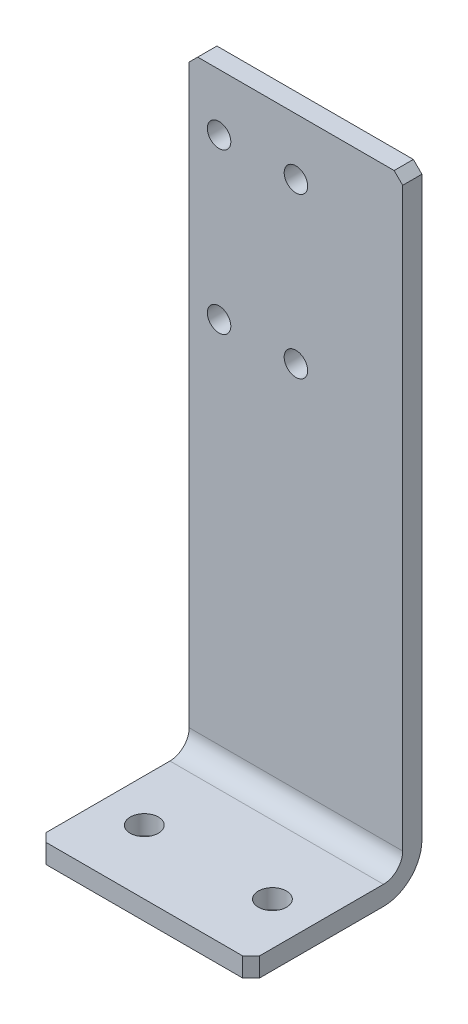
ISO-10303-21;
HEADER;
FILE_DESCRIPTION(('STEP AP214'),'2;1');
FILE_NAME('part.step','',(''),(''),'','','');
FILE_SCHEMA(('AUTOMOTIVE_DESIGN { 1 0 10303 214 1 1 1 1 }'));
ENDSEC;
DATA;
#1=APPLICATION_CONTEXT('core data for automotive mechanical design processes');
#2=APPLICATION_PROTOCOL_DEFINITION('international standard','automotive_design',2000,#1);
#3=PRODUCT_CONTEXT('',#1,'mechanical');
#4=PRODUCT('Part','Part','',(#3));
#5=PRODUCT_RELATED_PRODUCT_CATEGORY('part','',(#4));
#6=PRODUCT_DEFINITION_FORMATION('','',#4);
#7=PRODUCT_DEFINITION_CONTEXT('part definition',#1,'design');
#8=PRODUCT_DEFINITION('design','',#6,#7);
#9=PRODUCT_DEFINITION_SHAPE('','',#8);
#10=(LENGTH_UNIT() NAMED_UNIT(*) SI_UNIT(.MILLI.,.METRE.));
#11=(NAMED_UNIT(*) PLANE_ANGLE_UNIT() SI_UNIT($,.RADIAN.));
#12=(NAMED_UNIT(*) SI_UNIT($,.STERADIAN.) SOLID_ANGLE_UNIT());
#13=UNCERTAINTY_MEASURE_WITH_UNIT(LENGTH_MEASURE(1.E-05),#10,'distance_accuracy_value','');
#14=(GEOMETRIC_REPRESENTATION_CONTEXT(3) GLOBAL_UNCERTAINTY_ASSIGNED_CONTEXT((#13)) GLOBAL_UNIT_ASSIGNED_CONTEXT((#10,
#11,#12)) REPRESENTATION_CONTEXT('',''));
#15=CARTESIAN_POINT('',(0.,0.,0.));
#16=DIRECTION('',(0.,0.,1.));
#17=DIRECTION('',(1.,0.,0.));
#18=AXIS2_PLACEMENT_3D('',#15,#16,#17);
#19=CARTESIAN_POINT('',(25.,4.5,4.5));
#20=DIRECTION('',(0.,0.,-1.));
#21=DIRECTION('',(-1.,0.,0.));
#22=AXIS2_PLACEMENT_3D('',#19,#20,#21);
#23=PLANE('',#22);
#24=CARTESIAN_POINT('',(-18.,132.7,4.5));
#25=DIRECTION('',(0.,0.,-1.));
#26=DIRECTION('',(-1.,0.,0.));
#27=AXIS2_PLACEMENT_3D('',#24,#25,#26);
#28=CIRCLE('',#27,2.74999999999999);
#29=CARTESIAN_POINT('',(-20.75,132.7,4.5));
#30=VERTEX_POINT('',#29);
#31=EDGE_CURVE('E286',#30,#30,#28,.T.);
#32=ORIENTED_EDGE('',*,*,#31,.T.);
#33=EDGE_LOOP('',(#32));
#34=FACE_BOUND('',#33,.T.);
#35=CARTESIAN_POINT('',(0.,132.7,4.5));
#36=DIRECTION('',(0.,0.,-1.));
#37=DIRECTION('',(-1.,0.,0.));
#38=AXIS2_PLACEMENT_3D('',#35,#36,#37);
#39=CIRCLE('',#38,2.74999999999999);
#40=CARTESIAN_POINT('',(-2.75,132.7,4.5));
#41=VERTEX_POINT('',#40);
#42=EDGE_CURVE('E280',#41,#41,#39,.T.);
#43=ORIENTED_EDGE('',*,*,#42,.T.);
#44=EDGE_LOOP('',(#43));
#45=FACE_BOUND('',#44,.T.);
#46=CARTESIAN_POINT('',(0.,95.3,4.5));
#47=DIRECTION('',(0.,0.,-1.));
#48=DIRECTION('',(-1.,0.,0.));
#49=AXIS2_PLACEMENT_3D('',#46,#47,#48);
#50=CIRCLE('',#49,2.74999999999999);
#51=CARTESIAN_POINT('',(-2.75,95.3,4.5));
#52=VERTEX_POINT('',#51);
#53=EDGE_CURVE('E274',#52,#52,#50,.T.);
#54=ORIENTED_EDGE('',*,*,#53,.T.);
#55=EDGE_LOOP('',(#54));
#56=FACE_BOUND('',#55,.T.);
#57=CARTESIAN_POINT('',(-18.,95.3,4.5));
#58=DIRECTION('',(0.,0.,-1.));
#59=DIRECTION('',(-1.,0.,0.));
#60=AXIS2_PLACEMENT_3D('',#57,#58,#59);
#61=CIRCLE('',#60,2.74999999999999);
#62=CARTESIAN_POINT('',(-20.75,95.3,4.5));
#63=VERTEX_POINT('',#62);
#64=EDGE_CURVE('E268',#63,#63,#61,.T.);
#65=ORIENTED_EDGE('',*,*,#64,.T.);
#66=EDGE_LOOP('',(#65));
#67=FACE_BOUND('',#66,.T.);
#68=DIRECTION('',(-1.,0.,0.));
#69=VECTOR('',#68,1.);
#70=CARTESIAN_POINT('',(25.,146.,4.5));
#71=LINE('',#70,#69);
#72=CARTESIAN_POINT('',(23.,146.,4.5));
#73=VERTEX_POINT('',#72);
#74=CARTESIAN_POINT('',(-23.,146.,4.5));
#75=VERTEX_POINT('',#74);
#76=EDGE_CURVE('E164',#73,#75,#71,.T.);
#77=ORIENTED_EDGE('',*,*,#76,.T.);
#78=DIRECTION('',(0.707106781186545,0.70710678118655,0.));
#79=VECTOR('',#78,1.);
#80=CARTESIAN_POINT('',(-23.,146.,4.5));
#81=LINE('',#80,#79);
#82=CARTESIAN_POINT('',(-25.,144.,4.5));
#83=VERTEX_POINT('',#82);
#84=EDGE_CURVE('E216',#75,#83,#81,.F.);
#85=ORIENTED_EDGE('',*,*,#84,.T.);
#86=DIRECTION('',(0.,-1.,0.));
#87=VECTOR('',#86,1.);
#88=CARTESIAN_POINT('',(-25.,4.5,4.5));
#89=LINE('',#88,#87);
#90=CARTESIAN_POINT('',(-25.,9.,4.5));
#91=VERTEX_POINT('',#90);
#92=EDGE_CURVE('E154',#83,#91,#89,.T.);
#93=ORIENTED_EDGE('',*,*,#92,.T.);
#94=DIRECTION('',(-1.,0.,0.));
#95=VECTOR('',#94,1.);
#96=CARTESIAN_POINT('',(25.,9.,4.5));
#97=LINE('',#96,#95);
#98=CARTESIAN_POINT('',(25.,9.,4.5));
#99=VERTEX_POINT('',#98);
#100=EDGE_CURVE('E133',#91,#99,#97,.F.);
#101=ORIENTED_EDGE('',*,*,#100,.T.);
#102=DIRECTION('',(0.,-1.,0.));
#103=VECTOR('',#102,1.);
#104=CARTESIAN_POINT('',(25.,4.5,4.5));
#105=LINE('',#104,#103);
#106=CARTESIAN_POINT('',(25.,144.,4.5));
#107=VERTEX_POINT('',#106);
#108=EDGE_CURVE('E163',#107,#99,#105,.T.);
#109=ORIENTED_EDGE('',*,*,#108,.F.);
#110=DIRECTION('',(-0.707106781186545,0.70710678118655,0.));
#111=VECTOR('',#110,1.);
#112=CARTESIAN_POINT('',(25.,144.,4.5));
#113=LINE('',#112,#111);
#114=EDGE_CURVE('E214',#107,#73,#113,.T.);
#115=ORIENTED_EDGE('',*,*,#114,.T.);
#116=EDGE_LOOP('',(#77,#85,#93,#101,#109,#115));
#117=FACE_BOUND('',#116,.T.);
#118=ADVANCED_FACE('F37',(#34,#45,#56,#67,#117),#23,.F.);
#119=CARTESIAN_POINT('',(25.,4.5,4.5));
#120=DIRECTION('',(0.,-1.,0.));
#121=DIRECTION('',(0.,0.,-1.));
#122=AXIS2_PLACEMENT_3D('',#119,#120,#121);
#123=PLANE('',#122);
#124=CARTESIAN_POINT('',(-15.,4.5,25.));
#125=DIRECTION('',(0.,1.,0.));
#126=DIRECTION('',(0.,0.,1.));
#127=AXIS2_PLACEMENT_3D('',#124,#125,#126);
#128=CIRCLE('',#127,3.3);
#129=CARTESIAN_POINT('',(-15.,4.5,28.3));
#130=VERTEX_POINT('',#129);
#131=EDGE_CURVE('E265',#130,#130,#128,.T.);
#132=ORIENTED_EDGE('',*,*,#131,.F.);
#133=EDGE_LOOP('',(#132));
#134=FACE_BOUND('',#133,.T.);
#135=CARTESIAN_POINT('',(15.,4.5,25.));
#136=DIRECTION('',(0.,1.,0.));
#137=DIRECTION('',(0.,0.,1.));
#138=AXIS2_PLACEMENT_3D('',#135,#136,#137);
#139=CIRCLE('',#138,3.3);
#140=CARTESIAN_POINT('',(15.,4.5,28.3));
#141=VERTEX_POINT('',#140);
#142=EDGE_CURVE('E259',#141,#141,#139,.T.);
#143=ORIENTED_EDGE('',*,*,#142,.F.);
#144=EDGE_LOOP('',(#143));
#145=FACE_BOUND('',#144,.T.);
#146=DIRECTION('',(0.,0.,1.));
#147=VECTOR('',#146,1.);
#148=CARTESIAN_POINT('',(-25.,4.5,4.5));
#149=LINE('',#148,#147);
#150=CARTESIAN_POINT('',(-25.,4.5,9.));
#151=VERTEX_POINT('',#150);
#152=CARTESIAN_POINT('',(-25.,4.5,38.));
#153=VERTEX_POINT('',#152);
#154=EDGE_CURVE('E143',#151,#153,#149,.T.);
#155=ORIENTED_EDGE('',*,*,#154,.T.);
#156=DIRECTION('',(-0.707106781186545,0.,-0.70710678118655));
#157=VECTOR('',#156,1.);
#158=CARTESIAN_POINT('',(-23.,4.5,40.));
#159=LINE('',#158,#157);
#160=CARTESIAN_POINT('',(-23.,4.5,40.));
#161=VERTEX_POINT('',#160);
#162=EDGE_CURVE('E202',#153,#161,#159,.F.);
#163=ORIENTED_EDGE('',*,*,#162,.T.);
#164=DIRECTION('',(-1.,0.,0.));
#165=VECTOR('',#164,1.);
#166=CARTESIAN_POINT('',(25.,4.5,40.));
#167=LINE('',#166,#165);
#168=CARTESIAN_POINT('',(23.,4.5,40.));
#169=VERTEX_POINT('',#168);
#170=EDGE_CURVE('E147',#169,#161,#167,.T.);
#171=ORIENTED_EDGE('',*,*,#170,.F.);
#172=DIRECTION('',(0.70710678118655,0.,-0.707106781186545));
#173=VECTOR('',#172,1.);
#174=CARTESIAN_POINT('',(25.,4.5,38.));
#175=LINE('',#174,#173);
#176=CARTESIAN_POINT('',(25.,4.5,38.));
#177=VERTEX_POINT('',#176);
#178=EDGE_CURVE('E200',#169,#177,#175,.T.);
#179=ORIENTED_EDGE('',*,*,#178,.T.);
#180=DIRECTION('',(0.,0.,1.));
#181=VECTOR('',#180,1.);
#182=CARTESIAN_POINT('',(25.,4.5,4.5));
#183=LINE('',#182,#181);
#184=CARTESIAN_POINT('',(25.,4.5,9.));
#185=VERTEX_POINT('',#184);
#186=EDGE_CURVE('E146',#185,#177,#183,.T.);
#187=ORIENTED_EDGE('',*,*,#186,.F.);
#188=DIRECTION('',(-1.,0.,0.));
#189=VECTOR('',#188,1.);
#190=CARTESIAN_POINT('',(-25.,4.5,9.));
#191=LINE('',#190,#189);
#192=EDGE_CURVE('E131',#185,#151,#191,.T.);
#193=ORIENTED_EDGE('',*,*,#192,.T.);
#194=EDGE_LOOP('',(#155,#163,#171,#179,#187,#193));
#195=FACE_BOUND('',#194,.T.);
#196=ADVANCED_FACE('F142',(#134,#145,#195),#123,.F.);
#197=CARTESIAN_POINT('',(25.,0.,40.));
#198=DIRECTION('',(0.,0.,-1.));
#199=DIRECTION('',(-1.,0.,0.));
#200=AXIS2_PLACEMENT_3D('',#197,#198,#199);
#201=PLANE('',#200);
#202=ORIENTED_EDGE('',*,*,#170,.T.);
#203=DIRECTION('',(0.,-1.,0.));
#204=VECTOR('',#203,1.);
#205=CARTESIAN_POINT('',(-23.,0.,40.));
#206=LINE('',#205,#204);
#207=CARTESIAN_POINT('',(-23.,0.,40.));
#208=VERTEX_POINT('',#207);
#209=EDGE_CURVE('E190',#161,#208,#206,.T.);
#210=ORIENTED_EDGE('',*,*,#209,.T.);
#211=DIRECTION('',(-1.,0.,0.));
#212=VECTOR('',#211,1.);
#213=CARTESIAN_POINT('',(25.,0.,40.));
#214=LINE('',#213,#212);
#215=CARTESIAN_POINT('',(23.,0.,40.));
#216=VERTEX_POINT('',#215);
#217=EDGE_CURVE('E170',#216,#208,#214,.T.);
#218=ORIENTED_EDGE('',*,*,#217,.F.);
#219=DIRECTION('',(0.,1.,0.));
#220=VECTOR('',#219,1.);
#221=CARTESIAN_POINT('',(23.,4.5,40.));
#222=LINE('',#221,#220);
#223=EDGE_CURVE('E188',#216,#169,#222,.T.);
#224=ORIENTED_EDGE('',*,*,#223,.T.);
#225=EDGE_LOOP('',(#202,#210,#218,#224));
#226=FACE_BOUND('',#225,.T.);
#227=ADVANCED_FACE('F246',(#226),#201,.F.);
#228=CARTESIAN_POINT('',(25.,0.,0.));
#229=DIRECTION('',(0.,1.,0.));
#230=DIRECTION('',(0.,0.,1.));
#231=AXIS2_PLACEMENT_3D('',#228,#229,#230);
#232=PLANE('',#231);
#233=CARTESIAN_POINT('',(-15.,0.,25.));
#234=DIRECTION('',(0.,1.,0.));
#235=DIRECTION('',(0.,0.,1.));
#236=AXIS2_PLACEMENT_3D('',#233,#234,#235);
#237=CIRCLE('',#236,3.3);
#238=CARTESIAN_POINT('',(-15.,0.,28.3));
#239=VERTEX_POINT('',#238);
#240=EDGE_CURVE('E262',#239,#239,#237,.T.);
#241=ORIENTED_EDGE('',*,*,#240,.T.);
#242=EDGE_LOOP('',(#241));
#243=FACE_BOUND('',#242,.T.);
#244=CARTESIAN_POINT('',(15.,0.,25.));
#245=DIRECTION('',(0.,1.,0.));
#246=DIRECTION('',(0.,0.,1.));
#247=AXIS2_PLACEMENT_3D('',#244,#245,#246);
#248=CIRCLE('',#247,3.3);
#249=CARTESIAN_POINT('',(15.,0.,28.3));
#250=VERTEX_POINT('',#249);
#251=EDGE_CURVE('E158',#250,#250,#248,.T.);
#252=ORIENTED_EDGE('',*,*,#251,.T.);
#253=EDGE_LOOP('',(#252));
#254=FACE_BOUND('',#253,.T.);
#255=ORIENTED_EDGE('',*,*,#217,.T.);
#256=DIRECTION('',(0.707106781186545,0.,0.70710678118655));
#257=VECTOR('',#256,1.);
#258=CARTESIAN_POINT('',(-23.,0.,40.));
#259=LINE('',#258,#257);
#260=CARTESIAN_POINT('',(-25.,0.,38.));
#261=VERTEX_POINT('',#260);
#262=EDGE_CURVE('E195',#208,#261,#259,.F.);
#263=ORIENTED_EDGE('',*,*,#262,.T.);
#264=DIRECTION('',(0.,0.,-1.));
#265=VECTOR('',#264,1.);
#266=CARTESIAN_POINT('',(-25.,0.,0.));
#267=LINE('',#266,#265);
#268=CARTESIAN_POINT('',(-25.,0.,9.));
#269=VERTEX_POINT('',#268);
#270=EDGE_CURVE('E153',#261,#269,#267,.T.);
#271=ORIENTED_EDGE('',*,*,#270,.T.);
#272=DIRECTION('',(-1.,0.,0.));
#273=VECTOR('',#272,1.);
#274=CARTESIAN_POINT('',(25.,0.,9.));
#275=LINE('',#274,#273);
#276=CARTESIAN_POINT('',(25.,0.,9.));
#277=VERTEX_POINT('',#276);
#278=EDGE_CURVE('E183',#269,#277,#275,.F.);
#279=ORIENTED_EDGE('',*,*,#278,.T.);
#280=DIRECTION('',(0.,0.,-1.));
#281=VECTOR('',#280,1.);
#282=CARTESIAN_POINT('',(25.,0.,0.));
#283=LINE('',#282,#281);
#284=CARTESIAN_POINT('',(25.,0.,38.));
#285=VERTEX_POINT('',#284);
#286=EDGE_CURVE('E228',#285,#277,#283,.T.);
#287=ORIENTED_EDGE('',*,*,#286,.F.);
#288=DIRECTION('',(-0.70710678118655,0.,0.707106781186545));
#289=VECTOR('',#288,1.);
#290=CARTESIAN_POINT('',(25.,0.,38.));
#291=LINE('',#290,#289);
#292=EDGE_CURVE('E193',#285,#216,#291,.T.);
#293=ORIENTED_EDGE('',*,*,#292,.T.);
#294=EDGE_LOOP('',(#255,#263,#271,#279,#287,#293));
#295=FACE_BOUND('',#294,.T.);
#296=ADVANCED_FACE('F298',(#243,#254,#295),#232,.F.);
#297=CARTESIAN_POINT('',(25.,0.,0.));
#298=DIRECTION('',(0.,0.,1.));
#299=DIRECTION('',(1.,0.,0.));
#300=AXIS2_PLACEMENT_3D('',#297,#298,#299);
#301=PLANE('',#300);
#302=CARTESIAN_POINT('',(-18.,132.7,0.));
#303=DIRECTION('',(0.,0.,-1.));
#304=DIRECTION('',(-1.,0.,0.));
#305=AXIS2_PLACEMENT_3D('',#302,#303,#304);
#306=CIRCLE('',#305,2.75);
#307=CARTESIAN_POINT('',(-20.75,132.7,0.));
#308=VERTEX_POINT('',#307);
#309=EDGE_CURVE('E289',#308,#308,#306,.T.);
#310=ORIENTED_EDGE('',*,*,#309,.F.);
#311=EDGE_LOOP('',(#310));
#312=FACE_BOUND('',#311,.T.);
#313=CARTESIAN_POINT('',(0.,132.7,0.));
#314=DIRECTION('',(0.,0.,-1.));
#315=DIRECTION('',(-1.,0.,0.));
#316=AXIS2_PLACEMENT_3D('',#313,#314,#315);
#317=CIRCLE('',#316,2.75);
#318=CARTESIAN_POINT('',(-2.75,132.7,0.));
#319=VERTEX_POINT('',#318);
#320=EDGE_CURVE('E283',#319,#319,#317,.T.);
#321=ORIENTED_EDGE('',*,*,#320,.F.);
#322=EDGE_LOOP('',(#321));
#323=FACE_BOUND('',#322,.T.);
#324=CARTESIAN_POINT('',(0.,95.3,0.));
#325=DIRECTION('',(0.,0.,-1.));
#326=DIRECTION('',(-1.,0.,0.));
#327=AXIS2_PLACEMENT_3D('',#324,#325,#326);
#328=CIRCLE('',#327,2.75);
#329=CARTESIAN_POINT('',(-2.75,95.3,0.));
#330=VERTEX_POINT('',#329);
#331=EDGE_CURVE('E277',#330,#330,#328,.T.);
#332=ORIENTED_EDGE('',*,*,#331,.F.);
#333=EDGE_LOOP('',(#332));
#334=FACE_BOUND('',#333,.T.);
#335=CARTESIAN_POINT('',(-18.,95.3,0.));
#336=DIRECTION('',(0.,0.,-1.));
#337=DIRECTION('',(-1.,0.,0.));
#338=AXIS2_PLACEMENT_3D('',#335,#336,#337);
#339=CIRCLE('',#338,2.75);
#340=CARTESIAN_POINT('',(-20.75,95.3,0.));
#341=VERTEX_POINT('',#340);
#342=EDGE_CURVE('E271',#341,#341,#339,.T.);
#343=ORIENTED_EDGE('',*,*,#342,.F.);
#344=EDGE_LOOP('',(#343));
#345=FACE_BOUND('',#344,.T.);
#346=DIRECTION('',(0.,1.,0.));
#347=VECTOR('',#346,1.);
#348=CARTESIAN_POINT('',(-25.,0.,0.));
#349=LINE('',#348,#347);
#350=CARTESIAN_POINT('',(-25.,9.,0.));
#351=VERTEX_POINT('',#350);
#352=CARTESIAN_POINT('',(-25.,144.,0.));
#353=VERTEX_POINT('',#352);
#354=EDGE_CURVE('E156',#351,#353,#349,.T.);
#355=ORIENTED_EDGE('',*,*,#354,.T.);
#356=DIRECTION('',(-0.707106781186545,-0.70710678118655,0.));
#357=VECTOR('',#356,1.);
#358=CARTESIAN_POINT('',(-23.,146.,0.));
#359=LINE('',#358,#357);
#360=CARTESIAN_POINT('',(-23.,146.,0.));
#361=VERTEX_POINT('',#360);
#362=EDGE_CURVE('E11',#353,#361,#359,.F.);
#363=ORIENTED_EDGE('',*,*,#362,.T.);
#364=DIRECTION('',(-1.,0.,0.));
#365=VECTOR('',#364,1.);
#366=CARTESIAN_POINT('',(25.,146.,0.));
#367=LINE('',#366,#365);
#368=CARTESIAN_POINT('',(23.,146.,0.));
#369=VERTEX_POINT('',#368);
#370=EDGE_CURVE('E167',#369,#361,#367,.T.);
#371=ORIENTED_EDGE('',*,*,#370,.F.);
#372=DIRECTION('',(0.707106781186545,-0.70710678118655,0.));
#373=VECTOR('',#372,1.);
#374=CARTESIAN_POINT('',(25.,144.,0.));
#375=LINE('',#374,#373);
#376=CARTESIAN_POINT('',(25.,144.,0.));
#377=VERTEX_POINT('',#376);
#378=EDGE_CURVE('E45',#369,#377,#375,.T.);
#379=ORIENTED_EDGE('',*,*,#378,.T.);
#380=DIRECTION('',(0.,1.,0.));
#381=VECTOR('',#380,1.);
#382=CARTESIAN_POINT('',(25.,0.,0.));
#383=LINE('',#382,#381);
#384=CARTESIAN_POINT('',(25.,9.,0.));
#385=VERTEX_POINT('',#384);
#386=EDGE_CURVE('E168',#385,#377,#383,.T.);
#387=ORIENTED_EDGE('',*,*,#386,.F.);
#388=DIRECTION('',(-1.,0.,0.));
#389=VECTOR('',#388,1.);
#390=CARTESIAN_POINT('',(25.,9.,0.));
#391=LINE('',#390,#389);
#392=EDGE_CURVE('E177',#385,#351,#391,.T.);
#393=ORIENTED_EDGE('',*,*,#392,.T.);
#394=EDGE_LOOP('',(#355,#363,#371,#379,#387,#393));
#395=FACE_BOUND('',#394,.T.);
#396=ADVANCED_FACE('F220',(#312,#323,#334,#345,#395),#301,.F.);
#397=CARTESIAN_POINT('',(25.,146.,0.));
#398=DIRECTION('',(0.,-1.,0.));
#399=DIRECTION('',(0.,0.,-1.));
#400=AXIS2_PLACEMENT_3D('',#397,#398,#399);
#401=PLANE('',#400);
#402=ORIENTED_EDGE('',*,*,#370,.T.);
#403=DIRECTION('',(0.,0.,1.));
#404=VECTOR('',#403,1.);
#405=CARTESIAN_POINT('',(-23.,146.,0.));
#406=LINE('',#405,#404);
#407=EDGE_CURVE('E211',#361,#75,#406,.T.);
#408=ORIENTED_EDGE('',*,*,#407,.T.);
#409=ORIENTED_EDGE('',*,*,#76,.F.);
#410=DIRECTION('',(0.,0.,-1.));
#411=VECTOR('',#410,1.);
#412=CARTESIAN_POINT('',(23.,146.,0.));
#413=LINE('',#412,#411);
#414=EDGE_CURVE('E57',#73,#369,#413,.T.);
#415=ORIENTED_EDGE('',*,*,#414,.T.);
#416=EDGE_LOOP('',(#402,#408,#409,#415));
#417=FACE_BOUND('',#416,.T.);
#418=ADVANCED_FACE('F230',(#417),#401,.F.);
#419=CARTESIAN_POINT('',(25.,146.,4.5));
#420=DIRECTION('',(1.,0.,0.));
#421=DIRECTION('',(0.,0.,-1.));
#422=AXIS2_PLACEMENT_3D('',#419,#420,#421);
#423=PLANE('',#422);
#424=ORIENTED_EDGE('',*,*,#186,.T.);
#425=DIRECTION('',(0.,-1.,0.));
#426=VECTOR('',#425,1.);
#427=CARTESIAN_POINT('',(25.,0.,38.));
#428=LINE('',#427,#426);
#429=EDGE_CURVE('E207',#177,#285,#428,.T.);
#430=ORIENTED_EDGE('',*,*,#429,.T.);
#431=ORIENTED_EDGE('',*,*,#286,.T.);
#432=CARTESIAN_POINT('',(25.,9.,9.));
#433=DIRECTION('',(1.,0.,0.));
#434=DIRECTION('',(0.,0.,-1.));
#435=AXIS2_PLACEMENT_3D('',#432,#433,#434);
#436=CIRCLE('',#435,9.);
#437=EDGE_CURVE('E186',#277,#385,#436,.T.);
#438=ORIENTED_EDGE('',*,*,#437,.T.);
#439=ORIENTED_EDGE('',*,*,#386,.T.);
#440=DIRECTION('',(0.,0.,1.));
#441=VECTOR('',#440,1.);
#442=CARTESIAN_POINT('',(25.,144.,4.5));
#443=LINE('',#442,#441);
#444=EDGE_CURVE('E204',#377,#107,#443,.T.);
#445=ORIENTED_EDGE('',*,*,#444,.T.);
#446=ORIENTED_EDGE('',*,*,#108,.T.);
#447=CARTESIAN_POINT('',(25.,9.,9.));
#448=DIRECTION('',(1.,0.,0.));
#449=DIRECTION('',(0.,0.,-1.));
#450=AXIS2_PLACEMENT_3D('',#447,#448,#449);
#451=CIRCLE('',#450,4.5);
#452=EDGE_CURVE('E137',#99,#185,#451,.F.);
#453=ORIENTED_EDGE('',*,*,#452,.T.);
#454=EDGE_LOOP('',(#424,#430,#431,#438,#439,#445,#446,#453));
#455=FACE_BOUND('',#454,.T.);
#456=ADVANCED_FACE('F225',(#455),#423,.T.);
#457=CARTESIAN_POINT('',(-25.,146.,4.5));
#458=DIRECTION('',(1.,0.,0.));
#459=DIRECTION('',(0.,0.,-1.));
#460=AXIS2_PLACEMENT_3D('',#457,#458,#459);
#461=PLANE('',#460);
#462=ORIENTED_EDGE('',*,*,#270,.F.);
#463=DIRECTION('',(0.,1.,0.));
#464=VECTOR('',#463,1.);
#465=CARTESIAN_POINT('',(-25.,146.,38.));
#466=LINE('',#465,#464);
#467=EDGE_CURVE('E152',#261,#153,#466,.T.);
#468=ORIENTED_EDGE('',*,*,#467,.T.);
#469=ORIENTED_EDGE('',*,*,#154,.F.);
#470=CARTESIAN_POINT('',(-25.,9.,9.));
#471=DIRECTION('',(1.,0.,0.));
#472=DIRECTION('',(0.,0.,-1.));
#473=AXIS2_PLACEMENT_3D('',#470,#471,#472);
#474=CIRCLE('',#473,4.5);
#475=EDGE_CURVE('E127',#151,#91,#474,.T.);
#476=ORIENTED_EDGE('',*,*,#475,.T.);
#477=ORIENTED_EDGE('',*,*,#92,.F.);
#478=DIRECTION('',(0.,0.,-1.));
#479=VECTOR('',#478,1.);
#480=CARTESIAN_POINT('',(-25.,144.,4.5));
#481=LINE('',#480,#479);
#482=EDGE_CURVE('E197',#83,#353,#481,.T.);
#483=ORIENTED_EDGE('',*,*,#482,.T.);
#484=ORIENTED_EDGE('',*,*,#354,.F.);
#485=CARTESIAN_POINT('',(-25.,9.,9.));
#486=DIRECTION('',(1.,0.,0.));
#487=DIRECTION('',(0.,0.,-1.));
#488=AXIS2_PLACEMENT_3D('',#485,#486,#487);
#489=CIRCLE('',#488,9.);
#490=EDGE_CURVE('E180',#351,#269,#489,.F.);
#491=ORIENTED_EDGE('',*,*,#490,.T.);
#492=EDGE_LOOP('',(#462,#468,#469,#476,#477,#483,#484,#491));
#493=FACE_BOUND('',#492,.T.);
#494=ADVANCED_FACE('F150',(#493),#461,.F.);
#495=CARTESIAN_POINT('',(25.,9.,9.));
#496=DIRECTION('',(1.,0.,0.));
#497=DIRECTION('',(0.,0.,-1.));
#498=AXIS2_PLACEMENT_3D('',#495,#496,#497);
#499=CYLINDRICAL_SURFACE('',#498,4.5);
#500=ORIENTED_EDGE('',*,*,#452,.F.);
#501=ORIENTED_EDGE('',*,*,#100,.F.);
#502=ORIENTED_EDGE('',*,*,#475,.F.);
#503=ORIENTED_EDGE('',*,*,#192,.F.);
#504=EDGE_LOOP('',(#500,#501,#502,#503));
#505=FACE_BOUND('',#504,.T.);
#506=ADVANCED_FACE('F130',(#505),#499,.F.);
#507=CARTESIAN_POINT('',(25.,9.,9.));
#508=DIRECTION('',(-1.,0.,0.));
#509=DIRECTION('',(0.,0.,1.));
#510=AXIS2_PLACEMENT_3D('',#507,#508,#509);
#511=CYLINDRICAL_SURFACE('',#510,9.);
#512=ORIENTED_EDGE('',*,*,#437,.F.);
#513=ORIENTED_EDGE('',*,*,#278,.F.);
#514=ORIENTED_EDGE('',*,*,#490,.F.);
#515=ORIENTED_EDGE('',*,*,#392,.F.);
#516=EDGE_LOOP('',(#512,#513,#514,#515));
#517=FACE_BOUND('',#516,.T.);
#518=ADVANCED_FACE('F237',(#517),#511,.T.);
#519=CARTESIAN_POINT('',(15.,4.5,25.));
#520=DIRECTION('',(0.,1.,0.));
#521=DIRECTION('',(0.,0.,1.));
#522=AXIS2_PLACEMENT_3D('',#519,#520,#521);
#523=CYLINDRICAL_SURFACE('',#522,3.3);
#524=ORIENTED_EDGE('',*,*,#251,.F.);
#525=EDGE_LOOP('',(#524));
#526=FACE_BOUND('',#525,.T.);
#527=ORIENTED_EDGE('',*,*,#142,.T.);
#528=EDGE_LOOP('',(#527));
#529=FACE_BOUND('',#528,.T.);
#530=ADVANCED_FACE('F330',(#526,#529),#523,.F.);
#531=CARTESIAN_POINT('',(-15.,4.5,25.));
#532=DIRECTION('',(0.,1.,0.));
#533=DIRECTION('',(0.,0.,1.));
#534=AXIS2_PLACEMENT_3D('',#531,#532,#533);
#535=CYLINDRICAL_SURFACE('',#534,3.3);
#536=ORIENTED_EDGE('',*,*,#240,.F.);
#537=EDGE_LOOP('',(#536));
#538=FACE_BOUND('',#537,.T.);
#539=ORIENTED_EDGE('',*,*,#131,.T.);
#540=EDGE_LOOP('',(#539));
#541=FACE_BOUND('',#540,.T.);
#542=ADVANCED_FACE('F310',(#538,#541),#535,.F.);
#543=CARTESIAN_POINT('',(-18.,95.3,0.));
#544=DIRECTION('',(0.,0.,-1.));
#545=DIRECTION('',(-1.,0.,0.));
#546=AXIS2_PLACEMENT_3D('',#543,#544,#545);
#547=CYLINDRICAL_SURFACE('',#546,2.74999999999999);
#548=ORIENTED_EDGE('',*,*,#342,.T.);
#549=EDGE_LOOP('',(#548));
#550=FACE_BOUND('',#549,.T.);
#551=ORIENTED_EDGE('',*,*,#64,.F.);
#552=EDGE_LOOP('',(#551));
#553=FACE_BOUND('',#552,.T.);
#554=ADVANCED_FACE('F306',(#550,#553),#547,.F.);
#555=CARTESIAN_POINT('',(0.,95.3,0.));
#556=DIRECTION('',(0.,0.,-1.));
#557=DIRECTION('',(-1.,0.,0.));
#558=AXIS2_PLACEMENT_3D('',#555,#556,#557);
#559=CYLINDRICAL_SURFACE('',#558,2.74999999999999);
#560=ORIENTED_EDGE('',*,*,#331,.T.);
#561=EDGE_LOOP('',(#560));
#562=FACE_BOUND('',#561,.T.);
#563=ORIENTED_EDGE('',*,*,#53,.F.);
#564=EDGE_LOOP('',(#563));
#565=FACE_BOUND('',#564,.T.);
#566=ADVANCED_FACE('F309',(#562,#565),#559,.F.);
#567=CARTESIAN_POINT('',(0.,132.7,0.));
#568=DIRECTION('',(0.,0.,-1.));
#569=DIRECTION('',(-1.,0.,0.));
#570=AXIS2_PLACEMENT_3D('',#567,#568,#569);
#571=CYLINDRICAL_SURFACE('',#570,2.74999999999999);
#572=ORIENTED_EDGE('',*,*,#320,.T.);
#573=EDGE_LOOP('',(#572));
#574=FACE_BOUND('',#573,.T.);
#575=ORIENTED_EDGE('',*,*,#42,.F.);
#576=EDGE_LOOP('',(#575));
#577=FACE_BOUND('',#576,.T.);
#578=ADVANCED_FACE('F357',(#574,#577),#571,.F.);
#579=CARTESIAN_POINT('',(-18.,132.7,0.));
#580=DIRECTION('',(0.,0.,-1.));
#581=DIRECTION('',(-1.,0.,0.));
#582=AXIS2_PLACEMENT_3D('',#579,#580,#581);
#583=CYLINDRICAL_SURFACE('',#582,2.74999999999999);
#584=ORIENTED_EDGE('',*,*,#309,.T.);
#585=EDGE_LOOP('',(#584));
#586=FACE_BOUND('',#585,.T.);
#587=ORIENTED_EDGE('',*,*,#31,.F.);
#588=EDGE_LOOP('',(#587));
#589=FACE_BOUND('',#588,.T.);
#590=ADVANCED_FACE('F293',(#586,#589),#583,.F.);
#591=CARTESIAN_POINT('',(-23.,0.,40.));
#592=DIRECTION('',(0.70710678118655,0.,-0.707106781186545));
#593=DIRECTION('',(-0.707106781186545,0.,-0.70710678118655));
#594=AXIS2_PLACEMENT_3D('',#591,#592,#593);
#595=PLANE('',#594);
#596=ORIENTED_EDGE('',*,*,#162,.F.);
#597=ORIENTED_EDGE('',*,*,#467,.F.);
#598=ORIENTED_EDGE('',*,*,#262,.F.);
#599=ORIENTED_EDGE('',*,*,#209,.F.);
#600=EDGE_LOOP('',(#596,#597,#598,#599));
#601=FACE_BOUND('',#600,.T.);
#602=ADVANCED_FACE('F241',(#601),#595,.F.);
#603=CARTESIAN_POINT('',(25.,146.,38.));
#604=DIRECTION('',(0.707106781186545,0.,0.70710678118655));
#605=DIRECTION('',(0.70710678118655,0.,-0.707106781186545));
#606=AXIS2_PLACEMENT_3D('',#603,#604,#605);
#607=PLANE('',#606);
#608=ORIENTED_EDGE('',*,*,#178,.F.);
#609=ORIENTED_EDGE('',*,*,#223,.F.);
#610=ORIENTED_EDGE('',*,*,#292,.F.);
#611=ORIENTED_EDGE('',*,*,#429,.F.);
#612=EDGE_LOOP('',(#608,#609,#610,#611));
#613=FACE_BOUND('',#612,.T.);
#614=ADVANCED_FACE('F250',(#613),#607,.T.);
#615=CARTESIAN_POINT('',(-23.,146.,0.));
#616=DIRECTION('',(0.70710678118655,-0.707106781186545,0.));
#617=DIRECTION('',(0.707106781186545,0.70710678118655,0.));
#618=AXIS2_PLACEMENT_3D('',#615,#616,#617);
#619=PLANE('',#618);
#620=ORIENTED_EDGE('',*,*,#362,.F.);
#621=ORIENTED_EDGE('',*,*,#482,.F.);
#622=ORIENTED_EDGE('',*,*,#84,.F.);
#623=ORIENTED_EDGE('',*,*,#407,.F.);
#624=EDGE_LOOP('',(#620,#621,#622,#623));
#625=FACE_BOUND('',#624,.T.);
#626=ADVANCED_FACE('F233',(#625),#619,.F.);
#627=CARTESIAN_POINT('',(25.,144.,4.5));
#628=DIRECTION('',(0.70710678118655,0.707106781186545,0.));
#629=DIRECTION('',(-0.707106781186545,0.70710678118655,0.));
#630=AXIS2_PLACEMENT_3D('',#627,#628,#629);
#631=PLANE('',#630);
#632=ORIENTED_EDGE('',*,*,#378,.F.);
#633=ORIENTED_EDGE('',*,*,#414,.F.);
#634=ORIENTED_EDGE('',*,*,#114,.F.);
#635=ORIENTED_EDGE('',*,*,#444,.F.);
#636=EDGE_LOOP('',(#632,#633,#634,#635));
#637=FACE_BOUND('',#636,.T.);
#638=ADVANCED_FACE('F39',(#637),#631,.T.);
#639=CLOSED_SHELL('',(#118,#196,#227,#296,#396,#418,#456,#494,#506,#518,#530,#542,#554,#566,
#578,#590,#602,#614,#626,#638));
#640=MANIFOLD_SOLID_BREP('B2',#639);
#641=ADVANCED_BREP_SHAPE_REPRESENTATION('',(#18,#640),#14);
#642=SHAPE_DEFINITION_REPRESENTATION(#9,#641);
ENDSEC;
END-ISO-10303-21;
